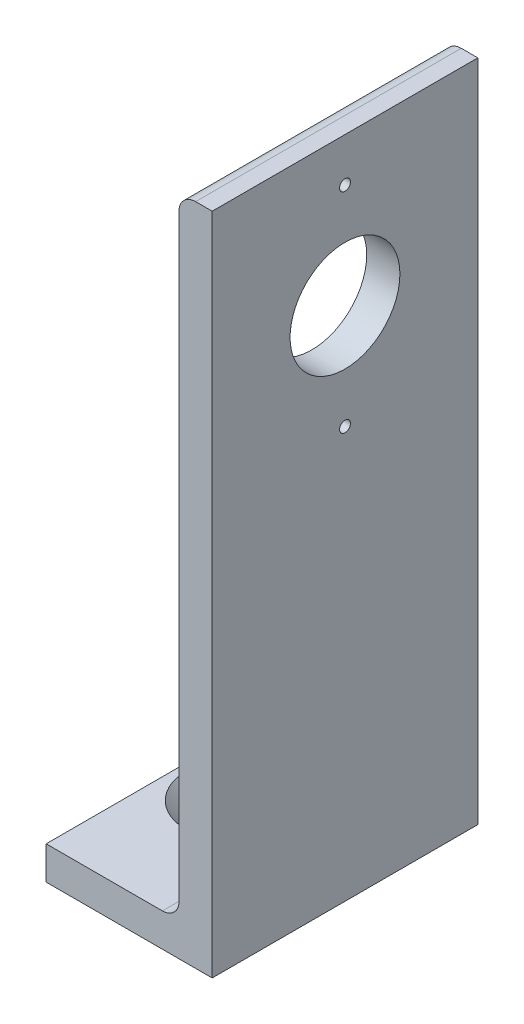
ISO-10303-21;
HEADER;
FILE_DESCRIPTION(('STEP AP214'),'2;1');
FILE_NAME('part.step','',(''),(''),'','','');
FILE_SCHEMA(('AUTOMOTIVE_DESIGN { 1 0 10303 214 1 1 1 1 }'));
ENDSEC;
DATA;
#1=APPLICATION_CONTEXT('core data for automotive mechanical design processes');
#2=APPLICATION_PROTOCOL_DEFINITION('international standard','automotive_design',2000,#1);
#3=PRODUCT_CONTEXT('',#1,'mechanical');
#4=PRODUCT('Part','Part','',(#3));
#5=PRODUCT_RELATED_PRODUCT_CATEGORY('part','',(#4));
#6=PRODUCT_DEFINITION_FORMATION('','',#4);
#7=PRODUCT_DEFINITION_CONTEXT('part definition',#1,'design');
#8=PRODUCT_DEFINITION('design','',#6,#7);
#9=PRODUCT_DEFINITION_SHAPE('','',#8);
#10=(LENGTH_UNIT() NAMED_UNIT(*) SI_UNIT(.MILLI.,.METRE.));
#11=(NAMED_UNIT(*) PLANE_ANGLE_UNIT() SI_UNIT($,.RADIAN.));
#12=(NAMED_UNIT(*) SI_UNIT($,.STERADIAN.) SOLID_ANGLE_UNIT());
#13=UNCERTAINTY_MEASURE_WITH_UNIT(LENGTH_MEASURE(1.E-05),#10,'distance_accuracy_value','');
#14=(GEOMETRIC_REPRESENTATION_CONTEXT(3) GLOBAL_UNCERTAINTY_ASSIGNED_CONTEXT((#13)) GLOBAL_UNIT_ASSIGNED_CONTEXT((#10,
#11,#12)) REPRESENTATION_CONTEXT('',''));
#15=CARTESIAN_POINT('',(0.,0.,0.));
#16=DIRECTION('',(0.,0.,1.));
#17=DIRECTION('',(1.,0.,0.));
#18=AXIS2_PLACEMENT_3D('',#15,#16,#17);
#19=CARTESIAN_POINT('',(-15.875,6.35,25.4));
#20=DIRECTION('',(1.,0.,0.));
#21=DIRECTION('',(0.,0.,-1.));
#22=AXIS2_PLACEMENT_3D('',#19,#20,#21);
#23=PLANE('',#22);
#24=DIRECTION('',(0.,-1.,0.));
#25=VECTOR('',#24,1.);
#26=CARTESIAN_POINT('',(-15.875,6.35,-25.4));
#27=LINE('',#26,#25);
#28=CARTESIAN_POINT('',(-15.875,6.35,-25.4));
#29=VERTEX_POINT('',#28);
#30=CARTESIAN_POINT('',(-15.875,0.,-25.4));
#31=VERTEX_POINT('',#30);
#32=EDGE_CURVE('E142',#29,#31,#27,.T.);
#33=ORIENTED_EDGE('',*,*,#32,.T.);
#34=DIRECTION('',(0.,0.,-1.));
#35=VECTOR('',#34,1.);
#36=CARTESIAN_POINT('',(-15.875,0.,25.4));
#37=LINE('',#36,#35);
#38=CARTESIAN_POINT('',(-15.875,0.,25.4));
#39=VERTEX_POINT('',#38);
#40=EDGE_CURVE('E11',#39,#31,#37,.T.);
#41=ORIENTED_EDGE('',*,*,#40,.F.);
#42=DIRECTION('',(0.,-1.,0.));
#43=VECTOR('',#42,1.);
#44=CARTESIAN_POINT('',(-15.875,6.35,25.4));
#45=LINE('',#44,#43);
#46=CARTESIAN_POINT('',(-15.875,6.35,25.4));
#47=VERTEX_POINT('',#46);
#48=EDGE_CURVE('E165',#47,#39,#45,.T.);
#49=ORIENTED_EDGE('',*,*,#48,.F.);
#50=DIRECTION('',(0.,0.,-1.));
#51=VECTOR('',#50,1.);
#52=CARTESIAN_POINT('',(-15.875,6.35,25.4));
#53=LINE('',#52,#51);
#54=EDGE_CURVE('E138',#47,#29,#53,.T.);
#55=ORIENTED_EDGE('',*,*,#54,.T.);
#56=EDGE_LOOP('',(#33,#41,#49,#55));
#57=FACE_BOUND('',#56,.T.);
#58=ADVANCED_FACE('F39',(#57),#23,.F.);
#59=CARTESIAN_POINT('',(-15.875,0.,25.4));
#60=DIRECTION('',(0.,1.,0.));
#61=DIRECTION('',(0.,0.,1.));
#62=AXIS2_PLACEMENT_3D('',#59,#60,#61);
#63=PLANE('',#62);
#64=CARTESIAN_POINT('',(-4.826,0.,0.));
#65=DIRECTION('',(0.,1.,0.));
#66=DIRECTION('',(0.,0.,1.));
#67=AXIS2_PLACEMENT_3D('',#64,#65,#66);
#68=CIRCLE('',#67,5.15874);
#69=CARTESIAN_POINT('',(-4.826,0.,5.15873999999999));
#70=VERTEX_POINT('',#69);
#71=EDGE_CURVE('E202',#70,#70,#68,.T.);
#72=ORIENTED_EDGE('',*,*,#71,.T.);
#73=EDGE_LOOP('',(#72));
#74=FACE_BOUND('',#73,.T.);
#75=DIRECTION('',(1.,0.,0.));
#76=VECTOR('',#75,1.);
#77=CARTESIAN_POINT('',(-15.875,0.,-25.4));
#78=LINE('',#77,#76);
#79=CARTESIAN_POINT('',(15.875,0.,-25.4));
#80=VERTEX_POINT('',#79);
#81=EDGE_CURVE('E146',#31,#80,#78,.T.);
#82=ORIENTED_EDGE('',*,*,#81,.T.);
#83=DIRECTION('',(0.,0.,-1.));
#84=VECTOR('',#83,1.);
#85=CARTESIAN_POINT('',(15.875,0.,25.4));
#86=LINE('',#85,#84);
#87=CARTESIAN_POINT('',(15.875,0.,25.4));
#88=VERTEX_POINT('',#87);
#89=EDGE_CURVE('E49',#88,#80,#86,.T.);
#90=ORIENTED_EDGE('',*,*,#89,.F.);
#91=DIRECTION('',(1.,0.,0.));
#92=VECTOR('',#91,1.);
#93=CARTESIAN_POINT('',(-15.875,0.,25.4));
#94=LINE('',#93,#92);
#95=EDGE_CURVE('E101',#39,#88,#94,.T.);
#96=ORIENTED_EDGE('',*,*,#95,.F.);
#97=ORIENTED_EDGE('',*,*,#40,.T.);
#98=EDGE_LOOP('',(#82,#90,#96,#97));
#99=FACE_BOUND('',#98,.T.);
#100=ADVANCED_FACE('F250',(#74,#99),#63,.F.);
#101=CARTESIAN_POINT('',(15.875,0.,25.4));
#102=DIRECTION('',(-1.,0.,0.));
#103=DIRECTION('',(0.,0.,1.));
#104=AXIS2_PLACEMENT_3D('',#101,#102,#103);
#105=PLANE('',#104);
#106=CARTESIAN_POINT('',(15.875,78.65,0.));
#107=DIRECTION('',(1.,0.,0.));
#108=DIRECTION('',(0.,0.,-1.));
#109=AXIS2_PLACEMENT_3D('',#106,#107,#108);
#110=CIRCLE('',#109,1.04);
#111=CARTESIAN_POINT('',(15.875,78.65,-1.04));
#112=VERTEX_POINT('',#111);
#113=EDGE_CURVE('E189',#112,#112,#110,.T.);
#114=ORIENTED_EDGE('',*,*,#113,.F.);
#115=EDGE_LOOP('',(#114));
#116=FACE_BOUND('',#115,.T.);
#117=CARTESIAN_POINT('',(15.875,118.65,0.));
#118=DIRECTION('',(1.,0.,0.));
#119=DIRECTION('',(0.,0.,1.));
#120=AXIS2_PLACEMENT_3D('',#117,#118,#119);
#121=CIRCLE('',#120,1.04);
#122=CARTESIAN_POINT('',(15.875,118.65,1.04));
#123=VERTEX_POINT('',#122);
#124=EDGE_CURVE('E196',#123,#123,#121,.T.);
#125=ORIENTED_EDGE('',*,*,#124,.F.);
#126=EDGE_LOOP('',(#125));
#127=FACE_BOUND('',#126,.T.);
#128=CARTESIAN_POINT('',(15.875,98.65,0.));
#129=DIRECTION('',(1.,0.,0.));
#130=DIRECTION('',(0.,0.,-1.));
#131=AXIS2_PLACEMENT_3D('',#128,#129,#130);
#132=CIRCLE('',#131,10.5);
#133=CARTESIAN_POINT('',(15.875,98.65,-10.5));
#134=VERTEX_POINT('',#133);
#135=EDGE_CURVE('E185',#134,#134,#132,.T.);
#136=ORIENTED_EDGE('',*,*,#135,.F.);
#137=EDGE_LOOP('',(#136));
#138=FACE_BOUND('',#137,.T.);
#139=DIRECTION('',(0.,1.,0.));
#140=VECTOR('',#139,1.);
#141=CARTESIAN_POINT('',(15.875,0.,-25.4));
#142=LINE('',#141,#140);
#143=CARTESIAN_POINT('',(15.875,127.,-25.4));
#144=VERTEX_POINT('',#143);
#145=EDGE_CURVE('E150',#80,#144,#142,.T.);
#146=ORIENTED_EDGE('',*,*,#145,.T.);
#147=DIRECTION('',(0.,0.,-1.));
#148=VECTOR('',#147,1.);
#149=CARTESIAN_POINT('',(15.875,127.,25.4));
#150=LINE('',#149,#148);
#151=CARTESIAN_POINT('',(15.875,127.,25.4));
#152=VERTEX_POINT('',#151);
#153=EDGE_CURVE('E176',#152,#144,#150,.T.);
#154=ORIENTED_EDGE('',*,*,#153,.F.);
#155=DIRECTION('',(0.,1.,0.));
#156=VECTOR('',#155,1.);
#157=CARTESIAN_POINT('',(15.875,0.,25.4));
#158=LINE('',#157,#156);
#159=EDGE_CURVE('E214',#88,#152,#158,.T.);
#160=ORIENTED_EDGE('',*,*,#159,.F.);
#161=ORIENTED_EDGE('',*,*,#89,.T.);
#162=EDGE_LOOP('',(#146,#154,#160,#161));
#163=FACE_BOUND('',#162,.T.);
#164=ADVANCED_FACE('F254',(#116,#127,#138,#163),#105,.F.);
#165=CARTESIAN_POINT('',(12.7,127.,25.4));
#166=DIRECTION('',(0.,-1.,0.));
#167=DIRECTION('',(0.,0.,-1.));
#168=AXIS2_PLACEMENT_3D('',#165,#166,#167);
#169=PLANE('',#168);
#170=DIRECTION('',(-1.,0.,0.));
#171=VECTOR('',#170,1.);
#172=CARTESIAN_POINT('',(12.7,127.,-25.4));
#173=LINE('',#172,#171);
#174=CARTESIAN_POINT('',(12.7,127.,-25.4));
#175=VERTEX_POINT('',#174);
#176=EDGE_CURVE('E153',#144,#175,#173,.T.);
#177=ORIENTED_EDGE('',*,*,#176,.T.);
#178=DIRECTION('',(0.,0.,-1.));
#179=VECTOR('',#178,1.);
#180=CARTESIAN_POINT('',(12.7,127.,25.4));
#181=LINE('',#180,#179);
#182=CARTESIAN_POINT('',(12.7,127.,25.4));
#183=VERTEX_POINT('',#182);
#184=EDGE_CURVE('E172',#183,#175,#181,.T.);
#185=ORIENTED_EDGE('',*,*,#184,.F.);
#186=DIRECTION('',(-1.,0.,0.));
#187=VECTOR('',#186,1.);
#188=CARTESIAN_POINT('',(12.7,127.,25.4));
#189=LINE('',#188,#187);
#190=EDGE_CURVE('E217',#152,#183,#189,.T.);
#191=ORIENTED_EDGE('',*,*,#190,.F.);
#192=ORIENTED_EDGE('',*,*,#153,.T.);
#193=EDGE_LOOP('',(#177,#185,#191,#192));
#194=FACE_BOUND('',#193,.T.);
#195=ADVANCED_FACE('F225',(#194),#169,.F.);
#196=CARTESIAN_POINT('',(12.7,123.825,25.4));
#197=DIRECTION('',(0.,0.,-1.));
#198=DIRECTION('',(-1.,0.,0.));
#199=AXIS2_PLACEMENT_3D('',#196,#197,#198);
#200=CYLINDRICAL_SURFACE('',#199,3.175);
#201=CARTESIAN_POINT('',(12.7,123.825,-25.4));
#202=DIRECTION('',(0.,0.,1.));
#203=DIRECTION('',(-1.,0.,0.));
#204=AXIS2_PLACEMENT_3D('',#201,#202,#203);
#205=CIRCLE('',#204,3.175);
#206=CARTESIAN_POINT('',(9.525,123.825,-25.4));
#207=VERTEX_POINT('',#206);
#208=EDGE_CURVE('E156',#175,#207,#205,.T.);
#209=ORIENTED_EDGE('',*,*,#208,.T.);
#210=DIRECTION('',(0.,0.,-1.));
#211=VECTOR('',#210,1.);
#212=CARTESIAN_POINT('',(9.525,123.825,25.4));
#213=LINE('',#212,#211);
#214=CARTESIAN_POINT('',(9.525,123.825,25.4));
#215=VERTEX_POINT('',#214);
#216=EDGE_CURVE('E131',#215,#207,#213,.T.);
#217=ORIENTED_EDGE('',*,*,#216,.F.);
#218=CARTESIAN_POINT('',(12.7,123.825,25.4));
#219=DIRECTION('',(0.,0.,1.));
#220=DIRECTION('',(-1.,0.,0.));
#221=AXIS2_PLACEMENT_3D('',#218,#219,#220);
#222=CIRCLE('',#221,3.175);
#223=EDGE_CURVE('E120',#183,#215,#222,.T.);
#224=ORIENTED_EDGE('',*,*,#223,.F.);
#225=ORIENTED_EDGE('',*,*,#184,.T.);
#226=EDGE_LOOP('',(#209,#217,#224,#225));
#227=FACE_BOUND('',#226,.T.);
#228=ADVANCED_FACE('F229',(#227),#200,.T.);
#229=CARTESIAN_POINT('',(9.525,123.825,25.4));
#230=DIRECTION('',(1.,0.,0.));
#231=DIRECTION('',(0.,1.,0.));
#232=AXIS2_PLACEMENT_3D('',#229,#230,#231);
#233=PLANE('',#232);
#234=CARTESIAN_POINT('',(9.52500000000001,78.65,0.));
#235=DIRECTION('',(1.,0.,0.));
#236=DIRECTION('',(0.,1.,0.));
#237=AXIS2_PLACEMENT_3D('',#234,#235,#236);
#238=CIRCLE('',#237,1.04);
#239=CARTESIAN_POINT('',(9.52500000000001,79.69,0.));
#240=VERTEX_POINT('',#239);
#241=EDGE_CURVE('E42',#240,#240,#238,.T.);
#242=ORIENTED_EDGE('',*,*,#241,.T.);
#243=EDGE_LOOP('',(#242));
#244=FACE_BOUND('',#243,.T.);
#245=CARTESIAN_POINT('',(9.525,118.65,0.));
#246=DIRECTION('',(1.,0.,0.));
#247=DIRECTION('',(0.,1.,0.));
#248=AXIS2_PLACEMENT_3D('',#245,#246,#247);
#249=CIRCLE('',#248,1.04);
#250=CARTESIAN_POINT('',(9.525,119.69,0.));
#251=VERTEX_POINT('',#250);
#252=EDGE_CURVE('E186',#251,#251,#249,.T.);
#253=ORIENTED_EDGE('',*,*,#252,.T.);
#254=EDGE_LOOP('',(#253));
#255=FACE_BOUND('',#254,.T.);
#256=CARTESIAN_POINT('',(9.52500000000001,98.65,0.));
#257=DIRECTION('',(1.,0.,0.));
#258=DIRECTION('',(0.,1.,0.));
#259=AXIS2_PLACEMENT_3D('',#256,#257,#258);
#260=CIRCLE('',#259,10.5);
#261=CARTESIAN_POINT('',(9.525,109.15,0.));
#262=VERTEX_POINT('',#261);
#263=EDGE_CURVE('E147',#262,#262,#260,.T.);
#264=ORIENTED_EDGE('',*,*,#263,.T.);
#265=EDGE_LOOP('',(#264));
#266=FACE_BOUND('',#265,.T.);
#267=DIRECTION('',(0.,-1.,0.));
#268=VECTOR('',#267,1.);
#269=CARTESIAN_POINT('',(9.525,123.825,-25.4));
#270=LINE('',#269,#268);
#271=CARTESIAN_POINT('',(9.52500000000003,9.52500000000001,-25.4));
#272=VERTEX_POINT('',#271);
#273=EDGE_CURVE('E129',#207,#272,#270,.T.);
#274=ORIENTED_EDGE('',*,*,#273,.T.);
#275=DIRECTION('',(0.,0.,-1.));
#276=VECTOR('',#275,1.);
#277=CARTESIAN_POINT('',(9.52500000000003,9.52500000000001,25.4));
#278=LINE('',#277,#276);
#279=CARTESIAN_POINT('',(9.52500000000003,9.52500000000001,25.4));
#280=VERTEX_POINT('',#279);
#281=EDGE_CURVE('E126',#280,#272,#278,.T.);
#282=ORIENTED_EDGE('',*,*,#281,.F.);
#283=DIRECTION('',(0.,-1.,0.));
#284=VECTOR('',#283,1.);
#285=CARTESIAN_POINT('',(9.525,123.825,25.4));
#286=LINE('',#285,#284);
#287=EDGE_CURVE('E114',#215,#280,#286,.T.);
#288=ORIENTED_EDGE('',*,*,#287,.F.);
#289=ORIENTED_EDGE('',*,*,#216,.T.);
#290=EDGE_LOOP('',(#274,#282,#288,#289));
#291=FACE_BOUND('',#290,.T.);
#292=ADVANCED_FACE('F127',(#244,#255,#266,#291),#233,.F.);
#293=CARTESIAN_POINT('',(6.35000000000003,9.52500000000001,25.4));
#294=DIRECTION('',(0.,0.,-1.));
#295=DIRECTION('',(-1.,0.,0.));
#296=AXIS2_PLACEMENT_3D('',#293,#294,#295);
#297=CYLINDRICAL_SURFACE('',#296,3.175);
#298=CARTESIAN_POINT('',(6.35000000000003,9.52500000000001,-25.4));
#299=DIRECTION('',(0.,0.,-1.));
#300=DIRECTION('',(-1.,0.,0.));
#301=AXIS2_PLACEMENT_3D('',#298,#299,#300);
#302=CIRCLE('',#301,3.175);
#303=CARTESIAN_POINT('',(6.35000000000003,6.35,-25.4));
#304=VERTEX_POINT('',#303);
#305=EDGE_CURVE('E87',#272,#304,#302,.T.);
#306=ORIENTED_EDGE('',*,*,#305,.T.);
#307=DIRECTION('',(0.,0.,-1.));
#308=VECTOR('',#307,1.);
#309=CARTESIAN_POINT('',(6.35000000000003,6.35,25.4));
#310=LINE('',#309,#308);
#311=CARTESIAN_POINT('',(6.35000000000003,6.35,25.4));
#312=VERTEX_POINT('',#311);
#313=EDGE_CURVE('E132',#312,#304,#310,.T.);
#314=ORIENTED_EDGE('',*,*,#313,.F.);
#315=CARTESIAN_POINT('',(6.35000000000003,9.52500000000001,25.4));
#316=DIRECTION('',(0.,0.,-1.));
#317=DIRECTION('',(-1.,0.,0.));
#318=AXIS2_PLACEMENT_3D('',#315,#316,#317);
#319=CIRCLE('',#318,3.175);
#320=EDGE_CURVE('E118',#280,#312,#319,.T.);
#321=ORIENTED_EDGE('',*,*,#320,.F.);
#322=ORIENTED_EDGE('',*,*,#281,.T.);
#323=EDGE_LOOP('',(#306,#314,#321,#322));
#324=FACE_BOUND('',#323,.T.);
#325=ADVANCED_FACE('F134',(#324),#297,.F.);
#326=CARTESIAN_POINT('',(6.35000000000003,6.35,25.4));
#327=DIRECTION('',(0.,-1.,0.));
#328=DIRECTION('',(1.,0.,0.));
#329=AXIS2_PLACEMENT_3D('',#326,#327,#328);
#330=PLANE('',#329);
#331=CARTESIAN_POINT('',(-4.826,6.35,0.));
#332=DIRECTION('',(0.,1.,0.));
#333=DIRECTION('',(0.,0.,1.));
#334=AXIS2_PLACEMENT_3D('',#331,#332,#333);
#335=CIRCLE('',#334,9.6774);
#336=CARTESIAN_POINT('',(-4.826,6.35,9.6774));
#337=VERTEX_POINT('',#336);
#338=EDGE_CURVE('E304',#337,#337,#335,.T.);
#339=ORIENTED_EDGE('',*,*,#338,.F.);
#340=EDGE_LOOP('',(#339));
#341=FACE_BOUND('',#340,.T.);
#342=DIRECTION('',(-1.,0.,0.));
#343=VECTOR('',#342,1.);
#344=CARTESIAN_POINT('',(6.35000000000003,6.35,-25.4));
#345=LINE('',#344,#343);
#346=EDGE_CURVE('E93',#304,#29,#345,.T.);
#347=ORIENTED_EDGE('',*,*,#346,.T.);
#348=ORIENTED_EDGE('',*,*,#54,.F.);
#349=DIRECTION('',(-1.,0.,0.));
#350=VECTOR('',#349,1.);
#351=CARTESIAN_POINT('',(6.35000000000003,6.35,25.4));
#352=LINE('',#351,#350);
#353=EDGE_CURVE('E58',#312,#47,#352,.T.);
#354=ORIENTED_EDGE('',*,*,#353,.F.);
#355=ORIENTED_EDGE('',*,*,#313,.T.);
#356=EDGE_LOOP('',(#347,#348,#354,#355));
#357=FACE_BOUND('',#356,.T.);
#358=ADVANCED_FACE('F237',(#341,#357),#330,.F.);
#359=CARTESIAN_POINT('',(12.7,123.825,25.4));
#360=DIRECTION('',(0.,0.,-1.));
#361=DIRECTION('',(-1.,0.,0.));
#362=AXIS2_PLACEMENT_3D('',#359,#360,#361);
#363=PLANE('',#362);
#364=ORIENTED_EDGE('',*,*,#48,.T.);
#365=ORIENTED_EDGE('',*,*,#95,.T.);
#366=ORIENTED_EDGE('',*,*,#159,.T.);
#367=ORIENTED_EDGE('',*,*,#190,.T.);
#368=ORIENTED_EDGE('',*,*,#223,.T.);
#369=ORIENTED_EDGE('',*,*,#287,.T.);
#370=ORIENTED_EDGE('',*,*,#320,.T.);
#371=ORIENTED_EDGE('',*,*,#353,.T.);
#372=EDGE_LOOP('',(#364,#365,#366,#367,#368,#369,#370,#371));
#373=FACE_BOUND('',#372,.T.);
#374=ADVANCED_FACE('F116',(#373),#363,.F.);
#375=CARTESIAN_POINT('',(12.7,123.825,-25.4));
#376=DIRECTION('',(0.,0.,-1.));
#377=DIRECTION('',(-1.,0.,0.));
#378=AXIS2_PLACEMENT_3D('',#375,#376,#377);
#379=PLANE('',#378);
#380=ORIENTED_EDGE('',*,*,#32,.F.);
#381=ORIENTED_EDGE('',*,*,#346,.F.);
#382=ORIENTED_EDGE('',*,*,#305,.F.);
#383=ORIENTED_EDGE('',*,*,#273,.F.);
#384=ORIENTED_EDGE('',*,*,#208,.F.);
#385=ORIENTED_EDGE('',*,*,#176,.F.);
#386=ORIENTED_EDGE('',*,*,#145,.F.);
#387=ORIENTED_EDGE('',*,*,#81,.F.);
#388=EDGE_LOOP('',(#380,#381,#382,#383,#384,#385,#386,#387));
#389=FACE_BOUND('',#388,.T.);
#390=ADVANCED_FACE('F232',(#389),#379,.T.);
#391=CARTESIAN_POINT('',(3.175,98.65,0.));
#392=DIRECTION('',(1.,0.,0.));
#393=DIRECTION('',(0.,0.,-1.));
#394=AXIS2_PLACEMENT_3D('',#391,#392,#393);
#395=CYLINDRICAL_SURFACE('',#394,10.5);
#396=ORIENTED_EDGE('',*,*,#135,.T.);
#397=EDGE_LOOP('',(#396));
#398=FACE_BOUND('',#397,.T.);
#399=ORIENTED_EDGE('',*,*,#263,.F.);
#400=EDGE_LOOP('',(#399));
#401=FACE_BOUND('',#400,.T.);
#402=ADVANCED_FACE('F275',(#398,#401),#395,.F.);
#403=CARTESIAN_POINT('',(5.875,118.65,0.));
#404=DIRECTION('',(1.,0.,0.));
#405=DIRECTION('',(0.,0.,-1.));
#406=AXIS2_PLACEMENT_3D('',#403,#404,#405);
#407=CYLINDRICAL_SURFACE('',#406,1.04);
#408=ORIENTED_EDGE('',*,*,#124,.T.);
#409=EDGE_LOOP('',(#408));
#410=FACE_BOUND('',#409,.T.);
#411=ORIENTED_EDGE('',*,*,#252,.F.);
#412=EDGE_LOOP('',(#411));
#413=FACE_BOUND('',#412,.T.);
#414=ADVANCED_FACE('F277',(#410,#413),#407,.F.);
#415=CARTESIAN_POINT('',(5.875,78.65,0.));
#416=DIRECTION('',(1.,0.,0.));
#417=DIRECTION('',(0.,0.,-1.));
#418=AXIS2_PLACEMENT_3D('',#415,#416,#417);
#419=CYLINDRICAL_SURFACE('',#418,1.04);
#420=ORIENTED_EDGE('',*,*,#113,.T.);
#421=EDGE_LOOP('',(#420));
#422=FACE_BOUND('',#421,.T.);
#423=ORIENTED_EDGE('',*,*,#241,.F.);
#424=EDGE_LOOP('',(#423));
#425=FACE_BOUND('',#424,.T.);
#426=ADVANCED_FACE('F284',(#422,#425),#419,.F.);
#427=CARTESIAN_POINT('',(-4.826,6.35,0.));
#428=DIRECTION('',(0.,1.,0.));
#429=DIRECTION('',(0.,0.,1.));
#430=AXIS2_PLACEMENT_3D('',#427,#428,#429);
#431=CYLINDRICAL_SURFACE('',#430,5.15874);
#432=ORIENTED_EDGE('',*,*,#71,.F.);
#433=EDGE_LOOP('',(#432));
#434=FACE_BOUND('',#433,.T.);
#435=CARTESIAN_POINT('',(-4.826,1.15187629302671,0.));
#436=DIRECTION('',(0.,1.,0.));
#437=DIRECTION('',(0.,0.,1.));
#438=AXIS2_PLACEMENT_3D('',#435,#436,#437);
#439=CIRCLE('',#438,5.15874);
#440=CARTESIAN_POINT('',(-4.826,1.15187629302671,5.15873999999999));
#441=VERTEX_POINT('',#440);
#442=EDGE_CURVE('E302',#441,#441,#439,.T.);
#443=ORIENTED_EDGE('',*,*,#442,.T.);
#444=EDGE_LOOP('',(#443));
#445=FACE_BOUND('',#444,.T.);
#446=ADVANCED_FACE('F290',(#434,#445),#431,.F.);
#447=CARTESIAN_POINT('',(-4.826,6.35,0.));
#448=DIRECTION('',(0.,1.,0.));
#449=DIRECTION('',(0.,0.,1.));
#450=AXIS2_PLACEMENT_3D('',#447,#448,#449);
#451=CONICAL_SURFACE('',#450,9.6774,0.715584993317675);
#452=ORIENTED_EDGE('',*,*,#442,.F.);
#453=EDGE_LOOP('',(#452));
#454=FACE_BOUND('',#453,.T.);
#455=ORIENTED_EDGE('',*,*,#338,.T.);
#456=EDGE_LOOP('',(#455));
#457=FACE_BOUND('',#456,.T.);
#458=ADVANCED_FACE('F293',(#454,#457),#451,.F.);
#459=CLOSED_SHELL('',(#58,#100,#164,#195,#228,#292,#325,#358,#374,#390,#402,#414,#426,#446,#458));
#460=MANIFOLD_SOLID_BREP('B2',#459);
#461=ADVANCED_BREP_SHAPE_REPRESENTATION('',(#18,#460),#14);
#462=SHAPE_DEFINITION_REPRESENTATION(#9,#461);
ENDSEC;
END-ISO-10303-21;
